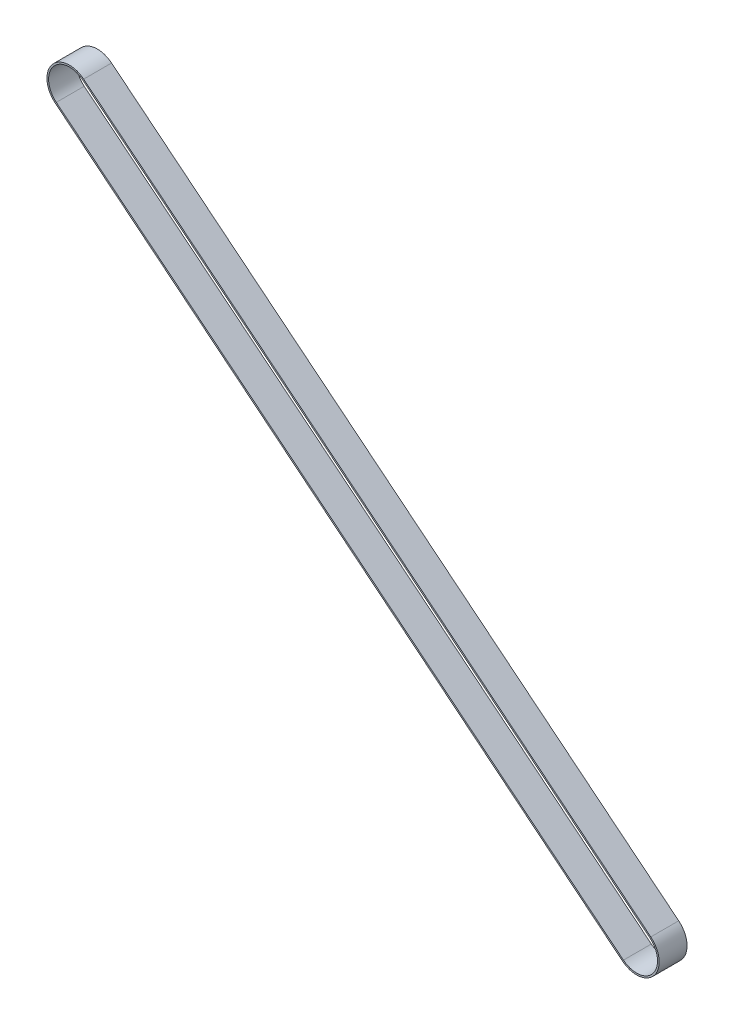
ISO-10303-21;
HEADER;
FILE_DESCRIPTION(('STEP AP214'),'2;1');
FILE_NAME('part.step','',(''),(''),'','','');
FILE_SCHEMA(('AUTOMOTIVE_DESIGN { 1 0 10303 214 1 1 1 1 }'));
ENDSEC;
DATA;
#1=APPLICATION_CONTEXT('core data for automotive mechanical design processes');
#2=APPLICATION_PROTOCOL_DEFINITION('international standard','automotive_design',2000,#1);
#3=PRODUCT_CONTEXT('',#1,'mechanical');
#4=PRODUCT('Part','Part','',(#3));
#5=PRODUCT_RELATED_PRODUCT_CATEGORY('part','',(#4));
#6=PRODUCT_DEFINITION_FORMATION('','',#4);
#7=PRODUCT_DEFINITION_CONTEXT('part definition',#1,'design');
#8=PRODUCT_DEFINITION('design','',#6,#7);
#9=PRODUCT_DEFINITION_SHAPE('','',#8);
#10=(LENGTH_UNIT() NAMED_UNIT(*) SI_UNIT(.MILLI.,.METRE.));
#11=(NAMED_UNIT(*) PLANE_ANGLE_UNIT() SI_UNIT($,.RADIAN.));
#12=(NAMED_UNIT(*) SI_UNIT($,.STERADIAN.) SOLID_ANGLE_UNIT());
#13=UNCERTAINTY_MEASURE_WITH_UNIT(LENGTH_MEASURE(1.E-05),#10,'distance_accuracy_value','');
#14=(GEOMETRIC_REPRESENTATION_CONTEXT(3) GLOBAL_UNCERTAINTY_ASSIGNED_CONTEXT((#13)) GLOBAL_UNIT_ASSIGNED_CONTEXT((#10,
#11,#12)) REPRESENTATION_CONTEXT('',''));
#15=CARTESIAN_POINT('',(0.,0.,0.));
#16=DIRECTION('',(0.,0.,1.));
#17=DIRECTION('',(1.,0.,0.));
#18=AXIS2_PLACEMENT_3D('',#15,#16,#17);
#19=CARTESIAN_POINT('',(-8.60422844084496E-13,-1.4432899320127E-12,3.));
#20=DIRECTION('',(0.,0.,-1.));
#21=DIRECTION('',(-1.,0.,0.));
#22=AXIS2_PLACEMENT_3D('',#19,#20,#21);
#23=PLANE('',#22);
#24=CARTESIAN_POINT('',(-8.60422844084496E-13,-1.4432899320127E-12,3.));
#25=DIRECTION('',(0.,0.,-1.));
#26=DIRECTION('',(-1.,0.,0.));
#27=AXIS2_PLACEMENT_3D('',#24,#25,#26);
#28=CIRCLE('',#27,4.85);
#29=CARTESIAN_POINT('',(3.0523223388344,3.7690619973458,3.));
#30=VERTEX_POINT('',#29);
#31=CARTESIAN_POINT('',(-3.05232233883612,-3.76906199734868,3.));
#32=VERTEX_POINT('',#31);
#33=EDGE_CURVE('E168',#30,#32,#28,.F.);
#34=ORIENTED_EDGE('',*,*,#33,.T.);
#35=DIRECTION('',(0.777126185020051,-0.629344812130982,0.));
#36=VECTOR('',#35,1.);
#37=CARTESIAN_POINT('',(-3.05232233883612,-3.76906199734869,3.));
#38=LINE('',#37,#36);
#39=CARTESIAN_POINT('',(118.94767766116,-102.569061997344,3.));
#40=VERTEX_POINT('',#39);
#41=EDGE_CURVE('E171',#32,#40,#38,.T.);
#42=ORIENTED_EDGE('',*,*,#41,.T.);
#43=CARTESIAN_POINT('',(121.999999999995,-98.7999999999964,3.));
#44=DIRECTION('',(0.,0.,-1.));
#45=DIRECTION('',(-1.,0.,0.));
#46=AXIS2_PLACEMENT_3D('',#43,#44,#45);
#47=CIRCLE('',#46,4.84999999999999);
#48=CARTESIAN_POINT('',(125.05232233883,-95.0309380026491,3.));
#49=VERTEX_POINT('',#48);
#50=EDGE_CURVE('E174',#40,#49,#47,.F.);
#51=ORIENTED_EDGE('',*,*,#50,.T.);
#52=DIRECTION('',(-0.777126185020051,0.629344812130982,0.));
#53=VECTOR('',#52,1.);
#54=CARTESIAN_POINT('',(3.0523223388344,3.7690619973458,3.));
#55=LINE('',#54,#53);
#56=EDGE_CURVE('E176',#49,#30,#55,.T.);
#57=ORIENTED_EDGE('',*,*,#56,.T.);
#58=EDGE_LOOP('',(#34,#42,#51,#57));
#59=FACE_BOUND('',#58,.T.);
#60=CARTESIAN_POINT('',(-8.60422844084496E-13,-1.4432899320127E-12,3.));
#61=DIRECTION('',(0.,0.,1.));
#62=DIRECTION('',(-1.,0.,0.));
#63=AXIS2_PLACEMENT_3D('',#60,#61,#62);
#64=CIRCLE('',#63,4.5);
#65=CARTESIAN_POINT('',(2.83205165458856,3.49706783258879,3.));
#66=VERTEX_POINT('',#65);
#67=CARTESIAN_POINT('',(-2.83205165459028,-3.49706783259167,3.));
#68=VERTEX_POINT('',#67);
#69=EDGE_CURVE('E132',#66,#68,#64,.T.);
#70=ORIENTED_EDGE('',*,*,#69,.F.);
#71=DIRECTION('',(-0.777126185020051,0.629344812130982,0.));
#72=VECTOR('',#71,1.);
#73=CARTESIAN_POINT('',(2.83205165458856,3.49706783258879,3.));
#74=LINE('',#73,#72);
#75=CARTESIAN_POINT('',(124.832051654584,-95.3029321674062,3.));
#76=VERTEX_POINT('',#75);
#77=EDGE_CURVE('E154',#76,#66,#74,.T.);
#78=ORIENTED_EDGE('',*,*,#77,.F.);
#79=CARTESIAN_POINT('',(121.999999999995,-98.7999999999964,3.));
#80=DIRECTION('',(0.,0.,1.));
#81=DIRECTION('',(-1.,0.,0.));
#82=AXIS2_PLACEMENT_3D('',#79,#80,#81);
#83=CIRCLE('',#82,4.49999999999999);
#84=CARTESIAN_POINT('',(119.167948345405,-102.297067832587,3.));
#85=VERTEX_POINT('',#84);
#86=EDGE_CURVE('E152',#85,#76,#83,.T.);
#87=ORIENTED_EDGE('',*,*,#86,.F.);
#88=DIRECTION('',(0.777126185020051,-0.629344812130982,0.));
#89=VECTOR('',#88,1.);
#90=CARTESIAN_POINT('',(119.167948345405,-102.297067832587,3.));
#91=LINE('',#90,#89);
#92=EDGE_CURVE('E140',#68,#85,#91,.T.);
#93=ORIENTED_EDGE('',*,*,#92,.F.);
#94=EDGE_LOOP('',(#70,#78,#87,#93));
#95=FACE_BOUND('',#94,.T.);
#96=ADVANCED_FACE('F67',(#59,#95),#23,.F.);
#97=CARTESIAN_POINT('',(-8.60422844084496E-13,-1.4432899320127E-12,-3.));
#98=DIRECTION('',(0.,0.,-1.));
#99=DIRECTION('',(-1.,0.,0.));
#100=AXIS2_PLACEMENT_3D('',#97,#98,#99);
#101=PLANE('',#100);
#102=CARTESIAN_POINT('',(-8.60422844084496E-13,-1.4432899320127E-12,-3.));
#103=DIRECTION('',(0.,0.,-1.));
#104=DIRECTION('',(-1.,0.,0.));
#105=AXIS2_PLACEMENT_3D('',#102,#103,#104);
#106=CIRCLE('',#105,4.85);
#107=CARTESIAN_POINT('',(3.0523223388344,3.7690619973458,-3.));
#108=VERTEX_POINT('',#107);
#109=CARTESIAN_POINT('',(-3.05232233883612,-3.76906199734868,-3.));
#110=VERTEX_POINT('',#109);
#111=EDGE_CURVE('E148',#108,#110,#106,.F.);
#112=ORIENTED_EDGE('',*,*,#111,.F.);
#113=DIRECTION('',(-0.777126185020051,0.629344812130982,0.));
#114=VECTOR('',#113,1.);
#115=CARTESIAN_POINT('',(3.0523223388344,3.7690619973458,-3.));
#116=LINE('',#115,#114);
#117=CARTESIAN_POINT('',(125.05232233883,-95.0309380026491,-3.));
#118=VERTEX_POINT('',#117);
#119=EDGE_CURVE('E172',#118,#108,#116,.T.);
#120=ORIENTED_EDGE('',*,*,#119,.F.);
#121=CARTESIAN_POINT('',(121.999999999995,-98.7999999999964,-3.));
#122=DIRECTION('',(0.,0.,-1.));
#123=DIRECTION('',(-1.,0.,0.));
#124=AXIS2_PLACEMENT_3D('',#121,#122,#123);
#125=CIRCLE('',#124,4.84999999999999);
#126=CARTESIAN_POINT('',(118.94767766116,-102.569061997344,-3.));
#127=VERTEX_POINT('',#126);
#128=EDGE_CURVE('E183',#127,#118,#125,.F.);
#129=ORIENTED_EDGE('',*,*,#128,.F.);
#130=DIRECTION('',(0.777126185020051,-0.629344812130982,0.));
#131=VECTOR('',#130,1.);
#132=CARTESIAN_POINT('',(-3.05232233883612,-3.76906199734869,-3.));
#133=LINE('',#132,#131);
#134=EDGE_CURVE('E181',#110,#127,#133,.T.);
#135=ORIENTED_EDGE('',*,*,#134,.F.);
#136=EDGE_LOOP('',(#112,#120,#129,#135));
#137=FACE_BOUND('',#136,.T.);
#138=DIRECTION('',(-0.777126185020051,0.629344812130982,0.));
#139=VECTOR('',#138,1.);
#140=CARTESIAN_POINT('',(2.83205165458856,3.49706783258879,-3.));
#141=LINE('',#140,#139);
#142=CARTESIAN_POINT('',(124.832051654584,-95.3029321674062,-3.));
#143=VERTEX_POINT('',#142);
#144=CARTESIAN_POINT('',(2.83205165458856,3.49706783258879,-3.));
#145=VERTEX_POINT('',#144);
#146=EDGE_CURVE('E141',#143,#145,#141,.T.);
#147=ORIENTED_EDGE('',*,*,#146,.T.);
#148=CARTESIAN_POINT('',(-8.60422844084496E-13,-1.4432899320127E-12,-3.));
#149=DIRECTION('',(0.,0.,1.));
#150=DIRECTION('',(-1.,0.,0.));
#151=AXIS2_PLACEMENT_3D('',#148,#149,#150);
#152=CIRCLE('',#151,4.5);
#153=CARTESIAN_POINT('',(-2.83205165459028,-3.49706783259167,-3.));
#154=VERTEX_POINT('',#153);
#155=EDGE_CURVE('E90',#145,#154,#152,.T.);
#156=ORIENTED_EDGE('',*,*,#155,.T.);
#157=DIRECTION('',(0.777126185020051,-0.629344812130982,0.));
#158=VECTOR('',#157,1.);
#159=CARTESIAN_POINT('',(119.167948345405,-102.297067832587,-3.));
#160=LINE('',#159,#158);
#161=CARTESIAN_POINT('',(119.167948345405,-102.297067832587,-3.));
#162=VERTEX_POINT('',#161);
#163=EDGE_CURVE('E147',#154,#162,#160,.T.);
#164=ORIENTED_EDGE('',*,*,#163,.T.);
#165=CARTESIAN_POINT('',(121.999999999995,-98.7999999999964,-3.));
#166=DIRECTION('',(0.,0.,1.));
#167=DIRECTION('',(-1.,0.,0.));
#168=AXIS2_PLACEMENT_3D('',#165,#166,#167);
#169=CIRCLE('',#168,4.49999999999999);
#170=EDGE_CURVE('E160',#162,#143,#169,.T.);
#171=ORIENTED_EDGE('',*,*,#170,.T.);
#172=EDGE_LOOP('',(#147,#156,#164,#171));
#173=FACE_BOUND('',#172,.T.);
#174=ADVANCED_FACE('F201',(#137,#173),#101,.T.);
#175=CARTESIAN_POINT('',(-8.60422844084496E-13,-1.4432899320127E-12,3.));
#176=DIRECTION('',(0.,0.,-1.));
#177=DIRECTION('',(-1.,0.,0.));
#178=AXIS2_PLACEMENT_3D('',#175,#176,#177);
#179=CYLINDRICAL_SURFACE('',#178,4.85);
#180=ORIENTED_EDGE('',*,*,#111,.T.);
#181=DIRECTION('',(0.,0.,-1.));
#182=VECTOR('',#181,1.);
#183=CARTESIAN_POINT('',(-3.05232233883612,-3.76906199734868,3.));
#184=LINE('',#183,#182);
#185=EDGE_CURVE('E12',#32,#110,#184,.T.);
#186=ORIENTED_EDGE('',*,*,#185,.F.);
#187=ORIENTED_EDGE('',*,*,#33,.F.);
#188=DIRECTION('',(0.,0.,-1.));
#189=VECTOR('',#188,1.);
#190=CARTESIAN_POINT('',(3.0523223388344,3.7690619973458,3.));
#191=LINE('',#190,#189);
#192=EDGE_CURVE('E178',#30,#108,#191,.T.);
#193=ORIENTED_EDGE('',*,*,#192,.T.);
#194=EDGE_LOOP('',(#180,#186,#187,#193));
#195=FACE_BOUND('',#194,.T.);
#196=ADVANCED_FACE('F69',(#195),#179,.T.);
#197=CARTESIAN_POINT('',(-3.05232233883612,-3.76906199734869,3.));
#198=DIRECTION('',(0.629344812130982,0.777126185020051,0.));
#199=DIRECTION('',(-0.777126185020051,0.629344812130982,0.));
#200=AXIS2_PLACEMENT_3D('',#197,#198,#199);
#201=PLANE('',#200);
#202=ORIENTED_EDGE('',*,*,#134,.T.);
#203=DIRECTION('',(0.,0.,-1.));
#204=VECTOR('',#203,1.);
#205=CARTESIAN_POINT('',(118.94767766116,-102.569061997344,3.));
#206=LINE('',#205,#204);
#207=EDGE_CURVE('E75',#40,#127,#206,.T.);
#208=ORIENTED_EDGE('',*,*,#207,.F.);
#209=ORIENTED_EDGE('',*,*,#41,.F.);
#210=ORIENTED_EDGE('',*,*,#185,.T.);
#211=EDGE_LOOP('',(#202,#208,#209,#210));
#212=FACE_BOUND('',#211,.T.);
#213=ADVANCED_FACE('F211',(#212),#201,.F.);
#214=CARTESIAN_POINT('',(121.999999999995,-98.7999999999964,3.));
#215=DIRECTION('',(0.,0.,-1.));
#216=DIRECTION('',(-1.,0.,0.));
#217=AXIS2_PLACEMENT_3D('',#214,#215,#216);
#218=CYLINDRICAL_SURFACE('',#217,4.84999999999999);
#219=ORIENTED_EDGE('',*,*,#128,.T.);
#220=DIRECTION('',(0.,0.,-1.));
#221=VECTOR('',#220,1.);
#222=CARTESIAN_POINT('',(125.05232233883,-95.0309380026491,3.));
#223=LINE('',#222,#221);
#224=EDGE_CURVE('E188',#49,#118,#223,.T.);
#225=ORIENTED_EDGE('',*,*,#224,.F.);
#226=ORIENTED_EDGE('',*,*,#50,.F.);
#227=ORIENTED_EDGE('',*,*,#207,.T.);
#228=EDGE_LOOP('',(#219,#225,#226,#227));
#229=FACE_BOUND('',#228,.T.);
#230=ADVANCED_FACE('F195',(#229),#218,.T.);
#231=CARTESIAN_POINT('',(3.0523223388344,3.7690619973458,3.));
#232=DIRECTION('',(-0.629344812130982,-0.777126185020051,0.));
#233=DIRECTION('',(0.777126185020051,-0.629344812130982,0.));
#234=AXIS2_PLACEMENT_3D('',#231,#232,#233);
#235=PLANE('',#234);
#236=ORIENTED_EDGE('',*,*,#119,.T.);
#237=ORIENTED_EDGE('',*,*,#192,.F.);
#238=ORIENTED_EDGE('',*,*,#56,.F.);
#239=ORIENTED_EDGE('',*,*,#224,.T.);
#240=EDGE_LOOP('',(#236,#237,#238,#239));
#241=FACE_BOUND('',#240,.T.);
#242=ADVANCED_FACE('F205',(#241),#235,.F.);
#243=CARTESIAN_POINT('',(-8.60422844084496E-13,-1.4432899320127E-12,3.));
#244=DIRECTION('',(0.,0.,-1.));
#245=DIRECTION('',(-1.,0.,0.));
#246=AXIS2_PLACEMENT_3D('',#243,#244,#245);
#247=CYLINDRICAL_SURFACE('',#246,4.5);
#248=ORIENTED_EDGE('',*,*,#155,.F.);
#249=DIRECTION('',(0.,0.,-1.));
#250=VECTOR('',#249,1.);
#251=CARTESIAN_POINT('',(2.83205165458856,3.49706783258879,3.));
#252=LINE('',#251,#250);
#253=EDGE_CURVE('E136',#66,#145,#252,.T.);
#254=ORIENTED_EDGE('',*,*,#253,.F.);
#255=ORIENTED_EDGE('',*,*,#69,.T.);
#256=DIRECTION('',(0.,0.,-1.));
#257=VECTOR('',#256,1.);
#258=CARTESIAN_POINT('',(-2.83205165459028,-3.49706783259167,3.));
#259=LINE('',#258,#257);
#260=EDGE_CURVE('E135',#68,#154,#259,.T.);
#261=ORIENTED_EDGE('',*,*,#260,.T.);
#262=EDGE_LOOP('',(#248,#254,#255,#261));
#263=FACE_BOUND('',#262,.T.);
#264=ADVANCED_FACE('F134',(#263),#247,.F.);
#265=CARTESIAN_POINT('',(119.167948345405,-102.297067832587,3.));
#266=DIRECTION('',(0.629344812130982,0.777126185020051,0.));
#267=DIRECTION('',(-0.777126185020051,0.629344812130982,0.));
#268=AXIS2_PLACEMENT_3D('',#265,#266,#267);
#269=PLANE('',#268);
#270=ORIENTED_EDGE('',*,*,#163,.F.);
#271=ORIENTED_EDGE('',*,*,#260,.F.);
#272=ORIENTED_EDGE('',*,*,#92,.T.);
#273=DIRECTION('',(0.,0.,-1.));
#274=VECTOR('',#273,1.);
#275=CARTESIAN_POINT('',(119.167948345405,-102.297067832587,3.));
#276=LINE('',#275,#274);
#277=EDGE_CURVE('E149',#85,#162,#276,.T.);
#278=ORIENTED_EDGE('',*,*,#277,.T.);
#279=EDGE_LOOP('',(#270,#271,#272,#278));
#280=FACE_BOUND('',#279,.T.);
#281=ADVANCED_FACE('F144',(#280),#269,.T.);
#282=CARTESIAN_POINT('',(121.999999999995,-98.7999999999964,3.));
#283=DIRECTION('',(0.,0.,-1.));
#284=DIRECTION('',(-1.,0.,0.));
#285=AXIS2_PLACEMENT_3D('',#282,#283,#284);
#286=CYLINDRICAL_SURFACE('',#285,4.49999999999999);
#287=ORIENTED_EDGE('',*,*,#170,.F.);
#288=ORIENTED_EDGE('',*,*,#277,.F.);
#289=ORIENTED_EDGE('',*,*,#86,.T.);
#290=DIRECTION('',(0.,0.,-1.));
#291=VECTOR('',#290,1.);
#292=CARTESIAN_POINT('',(124.832051654584,-95.3029321674062,3.));
#293=LINE('',#292,#291);
#294=EDGE_CURVE('E82',#76,#143,#293,.T.);
#295=ORIENTED_EDGE('',*,*,#294,.T.);
#296=EDGE_LOOP('',(#287,#288,#289,#295));
#297=FACE_BOUND('',#296,.T.);
#298=ADVANCED_FACE('F234',(#297),#286,.F.);
#299=CARTESIAN_POINT('',(2.83205165458856,3.49706783258879,3.));
#300=DIRECTION('',(-0.629344812130982,-0.777126185020051,0.));
#301=DIRECTION('',(0.777126185020051,-0.629344812130982,0.));
#302=AXIS2_PLACEMENT_3D('',#299,#300,#301);
#303=PLANE('',#302);
#304=ORIENTED_EDGE('',*,*,#146,.F.);
#305=ORIENTED_EDGE('',*,*,#294,.F.);
#306=ORIENTED_EDGE('',*,*,#77,.T.);
#307=ORIENTED_EDGE('',*,*,#253,.T.);
#308=EDGE_LOOP('',(#304,#305,#306,#307));
#309=FACE_BOUND('',#308,.T.);
#310=ADVANCED_FACE('F238',(#309),#303,.T.);
#311=CLOSED_SHELL('',(#96,#174,#196,#213,#230,#242,#264,#281,#298,#310));
#312=MANIFOLD_SOLID_BREP('B2',#311);
#313=ADVANCED_BREP_SHAPE_REPRESENTATION('',(#18,#312),#14);
#314=SHAPE_DEFINITION_REPRESENTATION(#9,#313);
ENDSEC;
END-ISO-10303-21;
